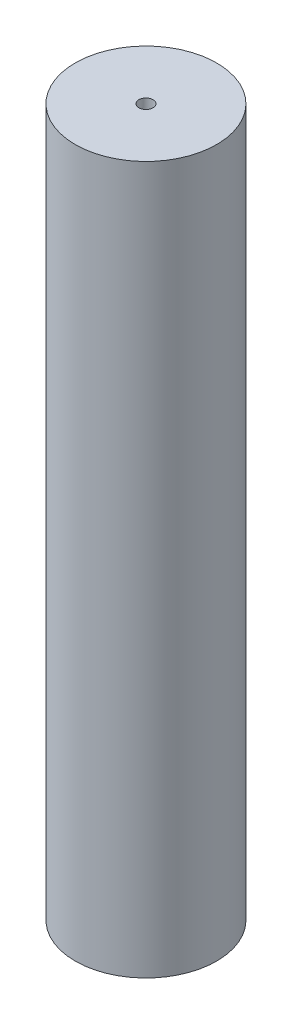
ISO-10303-21;
HEADER;
FILE_DESCRIPTION(('STEP AP214'),'2;1');
FILE_NAME('part.step','',(''),(''),'','','');
FILE_SCHEMA(('AUTOMOTIVE_DESIGN { 1 0 10303 214 1 1 1 1 }'));
ENDSEC;
DATA;
#1=APPLICATION_CONTEXT('core data for automotive mechanical design processes');
#2=APPLICATION_PROTOCOL_DEFINITION('international standard','automotive_design',2000,#1);
#3=PRODUCT_CONTEXT('',#1,'mechanical');
#4=PRODUCT('Part','Part','',(#3));
#5=PRODUCT_RELATED_PRODUCT_CATEGORY('part','',(#4));
#6=PRODUCT_DEFINITION_FORMATION('','',#4);
#7=PRODUCT_DEFINITION_CONTEXT('part definition',#1,'design');
#8=PRODUCT_DEFINITION('design','',#6,#7);
#9=PRODUCT_DEFINITION_SHAPE('','',#8);
#10=(LENGTH_UNIT() NAMED_UNIT(*) SI_UNIT(.MILLI.,.METRE.));
#11=(NAMED_UNIT(*) PLANE_ANGLE_UNIT() SI_UNIT($,.RADIAN.));
#12=(NAMED_UNIT(*) SI_UNIT($,.STERADIAN.) SOLID_ANGLE_UNIT());
#13=UNCERTAINTY_MEASURE_WITH_UNIT(LENGTH_MEASURE(1.E-05),#10,'distance_accuracy_value','');
#14=(GEOMETRIC_REPRESENTATION_CONTEXT(3) GLOBAL_UNCERTAINTY_ASSIGNED_CONTEXT((#13)) GLOBAL_UNIT_ASSIGNED_CONTEXT((#10,
#11,#12)) REPRESENTATION_CONTEXT('',''));
#15=CARTESIAN_POINT('',(0.,0.,0.));
#16=DIRECTION('',(0.,0.,1.));
#17=DIRECTION('',(1.,0.,0.));
#18=AXIS2_PLACEMENT_3D('',#15,#16,#17);
#19=CARTESIAN_POINT('',(0.,1000.,0.));
#20=DIRECTION('',(0.,-1.,0.));
#21=DIRECTION('',(0.,0.,-1.));
#22=AXIS2_PLACEMENT_3D('',#19,#20,#21);
#23=CYLINDRICAL_SURFACE('',#22,100.);
#24=CARTESIAN_POINT('',(0.,1000.,0.));
#25=DIRECTION('',(0.,1.,0.));
#26=DIRECTION('',(0.,0.,1.));
#27=AXIS2_PLACEMENT_3D('',#24,#25,#26);
#28=CIRCLE('',#27,100.);
#29=CARTESIAN_POINT('',(0.,1000.,100.));
#30=VERTEX_POINT('',#29);
#31=EDGE_CURVE('E10',#30,#30,#28,.T.);
#32=ORIENTED_EDGE('',*,*,#31,.F.);
#33=EDGE_LOOP('',(#32));
#34=FACE_BOUND('',#33,.T.);
#35=CARTESIAN_POINT('',(0.,0.,0.));
#36=DIRECTION('',(0.,1.,0.));
#37=DIRECTION('',(0.,0.,1.));
#38=AXIS2_PLACEMENT_3D('',#35,#36,#37);
#39=CIRCLE('',#38,100.);
#40=CARTESIAN_POINT('',(0.,0.,100.));
#41=VERTEX_POINT('',#40);
#42=EDGE_CURVE('E40',#41,#41,#39,.T.);
#43=ORIENTED_EDGE('',*,*,#42,.T.);
#44=EDGE_LOOP('',(#43));
#45=FACE_BOUND('',#44,.T.);
#46=ADVANCED_FACE('F37',(#34,#45),#23,.T.);
#47=CARTESIAN_POINT('',(0.,1000.,0.));
#48=DIRECTION('',(0.,1.,0.));
#49=DIRECTION('',(0.,0.,1.));
#50=AXIS2_PLACEMENT_3D('',#47,#48,#49);
#51=PLANE('',#50);
#52=CARTESIAN_POINT('',(0.,1000.,0.));
#53=DIRECTION('',(0.,1.,0.));
#54=DIRECTION('',(0.,0.,1.));
#55=AXIS2_PLACEMENT_3D('',#52,#53,#54);
#56=CIRCLE('',#55,10.);
#57=CARTESIAN_POINT('',(0.,1000.,10.));
#58=VERTEX_POINT('',#57);
#59=EDGE_CURVE('E51',#58,#58,#56,.T.);
#60=ORIENTED_EDGE('',*,*,#59,.F.);
#61=EDGE_LOOP('',(#60));
#62=FACE_BOUND('',#61,.T.);
#63=ORIENTED_EDGE('',*,*,#31,.T.);
#64=EDGE_LOOP('',(#63));
#65=FACE_BOUND('',#64,.T.);
#66=ADVANCED_FACE('F68',(#62,#65),#51,.T.);
#67=CARTESIAN_POINT('',(0.,0.,0.));
#68=DIRECTION('',(0.,1.,0.));
#69=DIRECTION('',(0.,0.,1.));
#70=AXIS2_PLACEMENT_3D('',#67,#68,#69);
#71=PLANE('',#70);
#72=ORIENTED_EDGE('',*,*,#42,.F.);
#73=EDGE_LOOP('',(#72));
#74=FACE_BOUND('',#73,.T.);
#75=ADVANCED_FACE('F64',(#74),#71,.F.);
#76=CARTESIAN_POINT('',(0.,980.,0.));
#77=DIRECTION('',(0.,1.,0.));
#78=DIRECTION('',(0.,0.,1.));
#79=AXIS2_PLACEMENT_3D('',#76,#77,#78);
#80=CYLINDRICAL_SURFACE('',#79,10.);
#81=CARTESIAN_POINT('',(0.,980.,0.));
#82=DIRECTION('',(0.,1.,0.));
#83=DIRECTION('',(0.,0.,1.));
#84=AXIS2_PLACEMENT_3D('',#81,#82,#83);
#85=CIRCLE('',#84,10.);
#86=CARTESIAN_POINT('',(0.,980.,10.));
#87=VERTEX_POINT('',#86);
#88=EDGE_CURVE('E49',#87,#87,#85,.T.);
#89=ORIENTED_EDGE('',*,*,#88,.F.);
#90=EDGE_LOOP('',(#89));
#91=FACE_BOUND('',#90,.T.);
#92=ORIENTED_EDGE('',*,*,#59,.T.);
#93=EDGE_LOOP('',(#92));
#94=FACE_BOUND('',#93,.T.);
#95=ADVANCED_FACE('F61',(#91,#94),#80,.F.);
#96=CARTESIAN_POINT('',(0.,980.,0.));
#97=DIRECTION('',(0.,1.,0.));
#98=DIRECTION('',(0.,0.,1.));
#99=AXIS2_PLACEMENT_3D('',#96,#97,#98);
#100=PLANE('',#99);
#101=ORIENTED_EDGE('',*,*,#88,.T.);
#102=EDGE_LOOP('',(#101));
#103=FACE_BOUND('',#102,.T.);
#104=ADVANCED_FACE('F59',(#103),#100,.T.);
#105=CLOSED_SHELL('',(#46,#66,#75,#95,#104));
#106=MANIFOLD_SOLID_BREP('B2',#105);
#107=ADVANCED_BREP_SHAPE_REPRESENTATION('',(#18,#106),#14);
#108=SHAPE_DEFINITION_REPRESENTATION(#9,#107);
ENDSEC;
END-ISO-10303-21;
